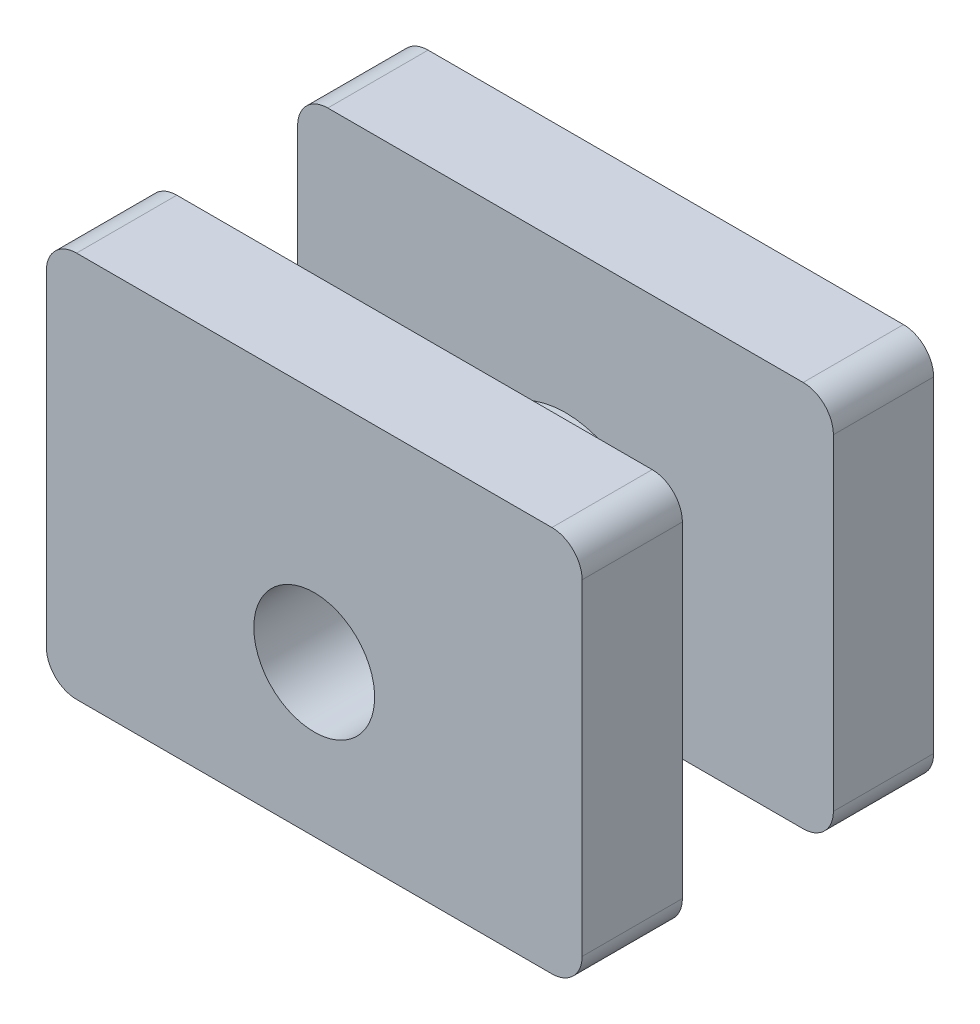
ISO-10303-21;
HEADER;
FILE_DESCRIPTION(('STEP AP214'),'2;1');
FILE_NAME('part.step','',(''),(''),'','','');
FILE_SCHEMA(('AUTOMOTIVE_DESIGN { 1 0 10303 214 1 1 1 1 }'));
ENDSEC;
DATA;
#1=APPLICATION_CONTEXT('core data for automotive mechanical design processes');
#2=APPLICATION_PROTOCOL_DEFINITION('international standard','automotive_design',2000,#1);
#3=PRODUCT_CONTEXT('',#1,'mechanical');
#4=PRODUCT('Part','Part','',(#3));
#5=PRODUCT_RELATED_PRODUCT_CATEGORY('part','',(#4));
#6=PRODUCT_DEFINITION_FORMATION('','',#4);
#7=PRODUCT_DEFINITION_CONTEXT('part definition',#1,'design');
#8=PRODUCT_DEFINITION('design','',#6,#7);
#9=PRODUCT_DEFINITION_SHAPE('','',#8);
#10=(LENGTH_UNIT() NAMED_UNIT(*) SI_UNIT(.MILLI.,.METRE.));
#11=(NAMED_UNIT(*) PLANE_ANGLE_UNIT() SI_UNIT($,.RADIAN.));
#12=(NAMED_UNIT(*) SI_UNIT($,.STERADIAN.) SOLID_ANGLE_UNIT());
#13=UNCERTAINTY_MEASURE_WITH_UNIT(LENGTH_MEASURE(1.E-05),#10,'distance_accuracy_value','');
#14=(GEOMETRIC_REPRESENTATION_CONTEXT(3) GLOBAL_UNCERTAINTY_ASSIGNED_CONTEXT((#13)) GLOBAL_UNIT_ASSIGNED_CONTEXT((#10,
#11,#12)) REPRESENTATION_CONTEXT('',''));
#15=CARTESIAN_POINT('',(0.,0.,0.));
#16=DIRECTION('',(0.,0.,1.));
#17=DIRECTION('',(1.,0.,0.));
#18=AXIS2_PLACEMENT_3D('',#15,#16,#17);
#19=CARTESIAN_POINT('',(3.935,2.7,-2.91));
#20=DIRECTION('',(0.,0.,-1.));
#21=DIRECTION('',(-1.,0.,0.));
#22=AXIS2_PLACEMENT_3D('',#19,#20,#21);
#23=CYLINDRICAL_SURFACE('',#22,0.500000000000003);
#24=CARTESIAN_POINT('',(3.935,2.7,-2.91));
#25=DIRECTION('',(0.,0.,-1.));
#26=DIRECTION('',(-1.,0.,0.));
#27=AXIS2_PLACEMENT_3D('',#24,#25,#26);
#28=CIRCLE('',#27,0.500000000000003);
#29=CARTESIAN_POINT('',(4.435,2.7,-2.91));
#30=VERTEX_POINT('',#29);
#31=CARTESIAN_POINT('',(3.935,3.2,-2.91));
#32=VERTEX_POINT('',#31);
#33=EDGE_CURVE('E156',#30,#32,#28,.F.);
#34=ORIENTED_EDGE('',*,*,#33,.T.);
#35=DIRECTION('',(0.,0.,1.));
#36=VECTOR('',#35,1.);
#37=CARTESIAN_POINT('',(3.935,3.2,-2.993));
#38=LINE('',#37,#36);
#39=CARTESIAN_POINT('',(3.935,3.2,-1.25));
#40=VERTEX_POINT('',#39);
#41=EDGE_CURVE('E154',#40,#32,#38,.F.);
#42=ORIENTED_EDGE('',*,*,#41,.F.);
#43=CARTESIAN_POINT('',(3.935,2.7,-1.25));
#44=DIRECTION('',(0.,0.,-1.));
#45=DIRECTION('',(-1.,0.,0.));
#46=AXIS2_PLACEMENT_3D('',#43,#44,#45);
#47=CIRCLE('',#46,0.500000000000003);
#48=CARTESIAN_POINT('',(4.435,2.7,-1.25));
#49=VERTEX_POINT('',#48);
#50=EDGE_CURVE('E20',#40,#49,#47,.T.);
#51=ORIENTED_EDGE('',*,*,#50,.T.);
#52=DIRECTION('',(0.,0.,-1.));
#53=VECTOR('',#52,1.);
#54=CARTESIAN_POINT('',(4.435,2.7,-1.167));
#55=LINE('',#54,#53);
#56=EDGE_CURVE('E151',#30,#49,#55,.F.);
#57=ORIENTED_EDGE('',*,*,#56,.F.);
#58=EDGE_LOOP('',(#34,#42,#51,#57));
#59=FACE_BOUND('',#58,.T.);
#60=ADVANCED_FACE('F17',(#59),#23,.T.);
#61=CARTESIAN_POINT('',(-3.935,2.7,-1.25));
#62=DIRECTION('',(0.,0.,1.));
#63=DIRECTION('',(1.,0.,0.));
#64=AXIS2_PLACEMENT_3D('',#61,#62,#63);
#65=CYLINDRICAL_SURFACE('',#64,0.500000000000003);
#66=CARTESIAN_POINT('',(-3.935,2.7,-2.91));
#67=DIRECTION('',(0.,0.,1.));
#68=DIRECTION('',(1.,0.,0.));
#69=AXIS2_PLACEMENT_3D('',#66,#67,#68);
#70=CIRCLE('',#69,0.500000000000003);
#71=CARTESIAN_POINT('',(-3.935,3.2,-2.91));
#72=VERTEX_POINT('',#71);
#73=CARTESIAN_POINT('',(-4.435,2.7,-2.91));
#74=VERTEX_POINT('',#73);
#75=EDGE_CURVE('E278',#72,#74,#70,.T.);
#76=ORIENTED_EDGE('',*,*,#75,.T.);
#77=DIRECTION('',(0.,0.,1.));
#78=VECTOR('',#77,1.);
#79=CARTESIAN_POINT('',(-4.435,2.7,-2.993));
#80=LINE('',#79,#78);
#81=CARTESIAN_POINT('',(-4.435,2.7,-1.25));
#82=VERTEX_POINT('',#81);
#83=EDGE_CURVE('E228',#82,#74,#80,.F.);
#84=ORIENTED_EDGE('',*,*,#83,.F.);
#85=CARTESIAN_POINT('',(-3.935,2.7,-1.25));
#86=DIRECTION('',(0.,0.,1.));
#87=DIRECTION('',(1.,0.,0.));
#88=AXIS2_PLACEMENT_3D('',#85,#86,#87);
#89=CIRCLE('',#88,0.500000000000003);
#90=CARTESIAN_POINT('',(-3.935,3.2,-1.25));
#91=VERTEX_POINT('',#90);
#92=EDGE_CURVE('E280',#82,#91,#89,.F.);
#93=ORIENTED_EDGE('',*,*,#92,.T.);
#94=DIRECTION('',(0.,0.,1.));
#95=VECTOR('',#94,1.);
#96=CARTESIAN_POINT('',(-3.935,3.2,-2.993));
#97=LINE('',#96,#95);
#98=EDGE_CURVE('E236',#72,#91,#97,.T.);
#99=ORIENTED_EDGE('',*,*,#98,.F.);
#100=EDGE_LOOP('',(#76,#84,#93,#99));
#101=FACE_BOUND('',#100,.T.);
#102=ADVANCED_FACE('F290',(#101),#65,.T.);
#103=CARTESIAN_POINT('',(-3.935,2.7,2.91));
#104=DIRECTION('',(0.,0.,1.));
#105=DIRECTION('',(1.,0.,0.));
#106=AXIS2_PLACEMENT_3D('',#103,#104,#105);
#107=CYLINDRICAL_SURFACE('',#106,0.500000000000003);
#108=CARTESIAN_POINT('',(-3.935,2.7,2.91));
#109=DIRECTION('',(0.,0.,1.));
#110=DIRECTION('',(1.,0.,0.));
#111=AXIS2_PLACEMENT_3D('',#108,#109,#110);
#112=CIRCLE('',#111,0.500000000000003);
#113=CARTESIAN_POINT('',(-4.435,2.7,2.91));
#114=VERTEX_POINT('',#113);
#115=CARTESIAN_POINT('',(-3.935,3.2,2.91));
#116=VERTEX_POINT('',#115);
#117=EDGE_CURVE('E274',#114,#116,#112,.F.);
#118=ORIENTED_EDGE('',*,*,#117,.T.);
#119=DIRECTION('',(0.,0.,1.));
#120=VECTOR('',#119,1.);
#121=CARTESIAN_POINT('',(-3.935,3.2,0.));
#122=LINE('',#121,#120);
#123=CARTESIAN_POINT('',(-3.935,3.2,1.25));
#124=VERTEX_POINT('',#123);
#125=EDGE_CURVE('E220',#124,#116,#122,.T.);
#126=ORIENTED_EDGE('',*,*,#125,.F.);
#127=CARTESIAN_POINT('',(-3.935,2.7,1.25));
#128=DIRECTION('',(0.,0.,1.));
#129=DIRECTION('',(1.,0.,0.));
#130=AXIS2_PLACEMENT_3D('',#127,#128,#129);
#131=CIRCLE('',#130,0.500000000000003);
#132=CARTESIAN_POINT('',(-4.435,2.7,1.25));
#133=VERTEX_POINT('',#132);
#134=EDGE_CURVE('E276',#124,#133,#131,.T.);
#135=ORIENTED_EDGE('',*,*,#134,.T.);
#136=DIRECTION('',(0.,0.,1.));
#137=VECTOR('',#136,1.);
#138=CARTESIAN_POINT('',(-4.435,2.7,0.));
#139=LINE('',#138,#137);
#140=EDGE_CURVE('E223',#114,#133,#139,.F.);
#141=ORIENTED_EDGE('',*,*,#140,.F.);
#142=EDGE_LOOP('',(#118,#126,#135,#141));
#143=FACE_BOUND('',#142,.T.);
#144=ADVANCED_FACE('F379',(#143),#107,.T.);
#145=CARTESIAN_POINT('',(3.935,2.7,1.25));
#146=DIRECTION('',(0.,0.,-1.));
#147=DIRECTION('',(-1.,0.,0.));
#148=AXIS2_PLACEMENT_3D('',#145,#146,#147);
#149=CYLINDRICAL_SURFACE('',#148,0.500000000000003);
#150=CARTESIAN_POINT('',(3.935,2.7,2.91));
#151=DIRECTION('',(0.,0.,-1.));
#152=DIRECTION('',(-1.,0.,0.));
#153=AXIS2_PLACEMENT_3D('',#150,#151,#152);
#154=CIRCLE('',#153,0.500000000000003);
#155=CARTESIAN_POINT('',(3.935,3.2,2.91));
#156=VERTEX_POINT('',#155);
#157=CARTESIAN_POINT('',(4.435,2.7,2.91));
#158=VERTEX_POINT('',#157);
#159=EDGE_CURVE('E164',#156,#158,#154,.T.);
#160=ORIENTED_EDGE('',*,*,#159,.T.);
#161=DIRECTION('',(0.,0.,-1.));
#162=VECTOR('',#161,1.);
#163=CARTESIAN_POINT('',(4.435,2.7,2.993));
#164=LINE('',#163,#162);
#165=CARTESIAN_POINT('',(4.435,2.7,1.25));
#166=VERTEX_POINT('',#165);
#167=EDGE_CURVE('E215',#166,#158,#164,.F.);
#168=ORIENTED_EDGE('',*,*,#167,.F.);
#169=CARTESIAN_POINT('',(3.935,2.7,1.25));
#170=DIRECTION('',(0.,0.,-1.));
#171=DIRECTION('',(-1.,0.,0.));
#172=AXIS2_PLACEMENT_3D('',#169,#170,#171);
#173=CIRCLE('',#172,0.500000000000003);
#174=CARTESIAN_POINT('',(3.935,3.2,1.25));
#175=VERTEX_POINT('',#174);
#176=EDGE_CURVE('E272',#166,#175,#173,.F.);
#177=ORIENTED_EDGE('',*,*,#176,.T.);
#178=DIRECTION('',(0.,0.,1.));
#179=VECTOR('',#178,1.);
#180=CARTESIAN_POINT('',(3.935,3.2,0.));
#181=LINE('',#180,#179);
#182=EDGE_CURVE('E219',#156,#175,#181,.F.);
#183=ORIENTED_EDGE('',*,*,#182,.F.);
#184=EDGE_LOOP('',(#160,#168,#177,#183));
#185=FACE_BOUND('',#184,.T.);
#186=ADVANCED_FACE('F388',(#185),#149,.T.);
#187=CARTESIAN_POINT('',(4.435,-2.97,-1.167));
#188=DIRECTION('',(1.,0.,0.));
#189=DIRECTION('',(0.,0.,-1.));
#190=AXIS2_PLACEMENT_3D('',#187,#188,#189);
#191=PLANE('',#190);
#192=DIRECTION('',(0.,1.,0.));
#193=VECTOR('',#192,1.);
#194=CARTESIAN_POINT('',(4.435,-3.52,-2.91));
#195=LINE('',#194,#193);
#196=CARTESIAN_POINT('',(4.435,-2.7,-2.91));
#197=VERTEX_POINT('',#196);
#198=EDGE_CURVE('E163',#30,#197,#195,.F.);
#199=ORIENTED_EDGE('',*,*,#198,.F.);
#200=ORIENTED_EDGE('',*,*,#56,.T.);
#201=DIRECTION('',(0.,1.,0.));
#202=VECTOR('',#201,1.);
#203=CARTESIAN_POINT('',(4.435,-3.52,-1.25));
#204=LINE('',#203,#202);
#205=CARTESIAN_POINT('',(4.435,-2.7,-1.25));
#206=VERTEX_POINT('',#205);
#207=EDGE_CURVE('E161',#206,#49,#204,.T.);
#208=ORIENTED_EDGE('',*,*,#207,.F.);
#209=DIRECTION('',(0.,0.,1.));
#210=VECTOR('',#209,1.);
#211=CARTESIAN_POINT('',(4.43499999999999,-2.7,-1.4965));
#212=LINE('',#211,#210);
#213=EDGE_CURVE('E177',#197,#206,#212,.T.);
#214=ORIENTED_EDGE('',*,*,#213,.F.);
#215=EDGE_LOOP('',(#199,#200,#208,#214));
#216=FACE_BOUND('',#215,.T.);
#217=ADVANCED_FACE('F159',(#216),#191,.T.);
#218=CARTESIAN_POINT('',(-4.3285,3.2,-2.993));
#219=DIRECTION('',(0.,1.,0.));
#220=DIRECTION('',(0.,0.,1.));
#221=AXIS2_PLACEMENT_3D('',#218,#219,#220);
#222=PLANE('',#221);
#223=DIRECTION('',(-1.,0.,0.));
#224=VECTOR('',#223,1.);
#225=CARTESIAN_POINT('',(4.8785,3.2,-2.91));
#226=LINE('',#225,#224);
#227=EDGE_CURVE('E190',#72,#32,#226,.F.);
#228=ORIENTED_EDGE('',*,*,#227,.F.);
#229=ORIENTED_EDGE('',*,*,#98,.T.);
#230=DIRECTION('',(1.,0.,0.));
#231=VECTOR('',#230,1.);
#232=CARTESIAN_POINT('',(-4.8785,3.2,-1.25));
#233=LINE('',#232,#231);
#234=EDGE_CURVE('E169',#40,#91,#233,.F.);
#235=ORIENTED_EDGE('',*,*,#234,.F.);
#236=ORIENTED_EDGE('',*,*,#41,.T.);
#237=EDGE_LOOP('',(#228,#229,#235,#236));
#238=FACE_BOUND('',#237,.T.);
#239=ADVANCED_FACE('F284',(#238),#222,.T.);
#240=CARTESIAN_POINT('',(-4.435,-2.97,-2.993));
#241=DIRECTION('',(-1.,0.,0.));
#242=DIRECTION('',(0.,0.,1.));
#243=AXIS2_PLACEMENT_3D('',#240,#241,#242);
#244=PLANE('',#243);
#245=DIRECTION('',(0.,1.,0.));
#246=VECTOR('',#245,1.);
#247=CARTESIAN_POINT('',(-4.435,-3.52,-2.91));
#248=LINE('',#247,#246);
#249=CARTESIAN_POINT('',(-4.435,-2.7,-2.91));
#250=VERTEX_POINT('',#249);
#251=EDGE_CURVE('E193',#250,#74,#248,.T.);
#252=ORIENTED_EDGE('',*,*,#251,.F.);
#253=DIRECTION('',(0.,0.,-1.));
#254=VECTOR('',#253,1.);
#255=CARTESIAN_POINT('',(-4.435,-2.7,-1.4965));
#256=LINE('',#255,#254);
#257=CARTESIAN_POINT('',(-4.435,-2.7,-1.25));
#258=VERTEX_POINT('',#257);
#259=EDGE_CURVE('E218',#258,#250,#256,.T.);
#260=ORIENTED_EDGE('',*,*,#259,.F.);
#261=DIRECTION('',(0.,1.,0.));
#262=VECTOR('',#261,1.);
#263=CARTESIAN_POINT('',(-4.435,-3.52,-1.25));
#264=LINE('',#263,#262);
#265=EDGE_CURVE('E171',#82,#258,#264,.F.);
#266=ORIENTED_EDGE('',*,*,#265,.F.);
#267=ORIENTED_EDGE('',*,*,#83,.T.);
#268=EDGE_LOOP('',(#252,#260,#266,#267));
#269=FACE_BOUND('',#268,.T.);
#270=ADVANCED_FACE('F294',(#269),#244,.T.);
#271=CARTESIAN_POINT('',(0.,-0.699999999999998,2.91));
#272=DIRECTION('',(0.,0.,-1.));
#273=DIRECTION('',(-1.,0.,0.));
#274=AXIS2_PLACEMENT_3D('',#271,#272,#273);
#275=CYLINDRICAL_SURFACE('',#274,1.);
#276=CARTESIAN_POINT('',(0.,-0.699999999999998,-2.91));
#277=DIRECTION('',(0.,0.,-1.));
#278=DIRECTION('',(-1.,0.,0.));
#279=AXIS2_PLACEMENT_3D('',#276,#277,#278);
#280=CIRCLE('',#279,1.);
#281=CARTESIAN_POINT('',(-1.,-0.699999999999998,-2.91));
#282=VERTEX_POINT('',#281);
#283=EDGE_CURVE('E189',#282,#282,#280,.F.);
#284=ORIENTED_EDGE('',*,*,#283,.F.);
#285=EDGE_LOOP('',(#284));
#286=FACE_BOUND('',#285,.T.);
#287=CARTESIAN_POINT('',(0.,-0.699999999999998,2.91));
#288=DIRECTION('',(0.,0.,-1.));
#289=DIRECTION('',(-1.,0.,0.));
#290=AXIS2_PLACEMENT_3D('',#287,#288,#289);
#291=CIRCLE('',#290,1.);
#292=CARTESIAN_POINT('',(-1.,-0.699999999999998,2.91));
#293=VERTEX_POINT('',#292);
#294=EDGE_CURVE('E256',#293,#293,#291,.T.);
#295=ORIENTED_EDGE('',*,*,#294,.F.);
#296=EDGE_LOOP('',(#295));
#297=FACE_BOUND('',#296,.T.);
#298=ADVANCED_FACE('F502',(#286,#297),#275,.F.);
#299=CARTESIAN_POINT('',(-4.435,-3.2,0.));
#300=DIRECTION('',(-1.,0.,0.));
#301=DIRECTION('',(0.,0.,1.));
#302=AXIS2_PLACEMENT_3D('',#299,#300,#301);
#303=PLANE('',#302);
#304=DIRECTION('',(0.,1.,0.));
#305=VECTOR('',#304,1.);
#306=CARTESIAN_POINT('',(-4.435,-3.52,2.91));
#307=LINE('',#306,#305);
#308=CARTESIAN_POINT('',(-4.435,-2.7,2.91));
#309=VERTEX_POINT('',#308);
#310=EDGE_CURVE('E259',#114,#309,#307,.F.);
#311=ORIENTED_EDGE('',*,*,#310,.F.);
#312=ORIENTED_EDGE('',*,*,#140,.T.);
#313=DIRECTION('',(0.,1.,0.));
#314=VECTOR('',#313,1.);
#315=CARTESIAN_POINT('',(-4.435,-3.52,1.25));
#316=LINE('',#315,#314);
#317=CARTESIAN_POINT('',(-4.435,-2.7,1.25));
#318=VERTEX_POINT('',#317);
#319=EDGE_CURVE('E253',#318,#133,#316,.T.);
#320=ORIENTED_EDGE('',*,*,#319,.F.);
#321=DIRECTION('',(0.,0.,-1.));
#322=VECTOR('',#321,1.);
#323=CARTESIAN_POINT('',(-4.435,-2.7,2.08));
#324=LINE('',#323,#322);
#325=EDGE_CURVE('E229',#309,#318,#324,.T.);
#326=ORIENTED_EDGE('',*,*,#325,.F.);
#327=EDGE_LOOP('',(#311,#312,#320,#326));
#328=FACE_BOUND('',#327,.T.);
#329=ADVANCED_FACE('F376',(#328),#303,.T.);
#330=CARTESIAN_POINT('',(-4.435,3.2,0.));
#331=DIRECTION('',(0.,1.,0.));
#332=DIRECTION('',(0.,0.,1.));
#333=AXIS2_PLACEMENT_3D('',#330,#331,#332);
#334=PLANE('',#333);
#335=DIRECTION('',(1.,0.,0.));
#336=VECTOR('',#335,1.);
#337=CARTESIAN_POINT('',(-4.8785,3.2,2.91));
#338=LINE('',#337,#336);
#339=EDGE_CURVE('E320',#156,#116,#338,.F.);
#340=ORIENTED_EDGE('',*,*,#339,.F.);
#341=ORIENTED_EDGE('',*,*,#182,.T.);
#342=DIRECTION('',(-1.,0.,0.));
#343=VECTOR('',#342,1.);
#344=CARTESIAN_POINT('',(4.8785,3.2,1.25));
#345=LINE('',#344,#343);
#346=EDGE_CURVE('E341',#124,#175,#345,.F.);
#347=ORIENTED_EDGE('',*,*,#346,.F.);
#348=ORIENTED_EDGE('',*,*,#125,.T.);
#349=EDGE_LOOP('',(#340,#341,#347,#348));
#350=FACE_BOUND('',#349,.T.);
#351=ADVANCED_FACE('F383',(#350),#334,.T.);
#352=CARTESIAN_POINT('',(4.435,-2.97,2.993));
#353=DIRECTION('',(1.,0.,0.));
#354=DIRECTION('',(0.,0.,-1.));
#355=AXIS2_PLACEMENT_3D('',#352,#353,#354);
#356=PLANE('',#355);
#357=DIRECTION('',(0.,1.,0.));
#358=VECTOR('',#357,1.);
#359=CARTESIAN_POINT('',(4.435,-3.52,2.91));
#360=LINE('',#359,#358);
#361=CARTESIAN_POINT('',(4.435,-2.7,2.91));
#362=VERTEX_POINT('',#361);
#363=EDGE_CURVE('E262',#362,#158,#360,.T.);
#364=ORIENTED_EDGE('',*,*,#363,.F.);
#365=DIRECTION('',(0.,0.,1.));
#366=VECTOR('',#365,1.);
#367=CARTESIAN_POINT('',(4.43499999999999,-2.7,2.08));
#368=LINE('',#367,#366);
#369=CARTESIAN_POINT('',(4.435,-2.7,1.25));
#370=VERTEX_POINT('',#369);
#371=EDGE_CURVE('E211',#370,#362,#368,.T.);
#372=ORIENTED_EDGE('',*,*,#371,.F.);
#373=DIRECTION('',(0.,1.,0.));
#374=VECTOR('',#373,1.);
#375=CARTESIAN_POINT('',(4.435,-3.52,1.25));
#376=LINE('',#375,#374);
#377=EDGE_CURVE('E249',#166,#370,#376,.F.);
#378=ORIENTED_EDGE('',*,*,#377,.F.);
#379=ORIENTED_EDGE('',*,*,#167,.T.);
#380=EDGE_LOOP('',(#364,#372,#378,#379));
#381=FACE_BOUND('',#380,.T.);
#382=ADVANCED_FACE('F391',(#381),#356,.T.);
#383=CARTESIAN_POINT('',(-3.935,-2.7,-2.91));
#384=DIRECTION('',(0.,0.,-1.));
#385=DIRECTION('',(-1.,0.,0.));
#386=AXIS2_PLACEMENT_3D('',#383,#384,#385);
#387=CYLINDRICAL_SURFACE('',#386,0.500000000000003);
#388=CARTESIAN_POINT('',(-3.935,-2.7,-2.91));
#389=DIRECTION('',(0.,0.,-1.));
#390=DIRECTION('',(-1.,0.,0.));
#391=AXIS2_PLACEMENT_3D('',#388,#389,#390);
#392=CIRCLE('',#391,0.500000000000003);
#393=CARTESIAN_POINT('',(-3.935,-3.2,-2.91));
#394=VERTEX_POINT('',#393);
#395=EDGE_CURVE('E196',#394,#250,#392,.T.);
#396=ORIENTED_EDGE('',*,*,#395,.F.);
#397=DIRECTION('',(0.,0.,-1.));
#398=VECTOR('',#397,1.);
#399=CARTESIAN_POINT('',(-3.935,-3.2,3.201));
#400=LINE('',#399,#398);
#401=CARTESIAN_POINT('',(-3.935,-3.2,-1.25));
#402=VERTEX_POINT('',#401);
#403=EDGE_CURVE('E187',#402,#394,#400,.T.);
#404=ORIENTED_EDGE('',*,*,#403,.F.);
#405=CARTESIAN_POINT('',(-3.935,-2.7,-1.25));
#406=DIRECTION('',(0.,0.,-1.));
#407=DIRECTION('',(-1.,0.,0.));
#408=AXIS2_PLACEMENT_3D('',#405,#406,#407);
#409=CIRCLE('',#408,0.500000000000003);
#410=EDGE_CURVE('E263',#258,#402,#409,.F.);
#411=ORIENTED_EDGE('',*,*,#410,.F.);
#412=ORIENTED_EDGE('',*,*,#259,.T.);
#413=EDGE_LOOP('',(#396,#404,#411,#412));
#414=FACE_BOUND('',#413,.T.);
#415=ADVANCED_FACE('F400',(#414),#387,.T.);
#416=CARTESIAN_POINT('',(4.8785,-3.52,-2.91));
#417=DIRECTION('',(0.,0.,-1.));
#418=DIRECTION('',(-1.,0.,0.));
#419=AXIS2_PLACEMENT_3D('',#416,#417,#418);
#420=PLANE('',#419);
#421=ORIENTED_EDGE('',*,*,#283,.T.);
#422=EDGE_LOOP('',(#421));
#423=FACE_BOUND('',#422,.T.);
#424=ORIENTED_EDGE('',*,*,#198,.T.);
#425=CARTESIAN_POINT('',(3.935,-2.7,-2.91));
#426=DIRECTION('',(0.,0.,-1.));
#427=DIRECTION('',(-1.,0.,0.));
#428=AXIS2_PLACEMENT_3D('',#425,#426,#427);
#429=CIRCLE('',#428,0.499999999999995);
#430=CARTESIAN_POINT('',(3.935,-3.2,-2.91));
#431=VERTEX_POINT('',#430);
#432=EDGE_CURVE('E241',#431,#197,#429,.F.);
#433=ORIENTED_EDGE('',*,*,#432,.F.);
#434=DIRECTION('',(1.,0.,0.));
#435=VECTOR('',#434,1.);
#436=CARTESIAN_POINT('',(-4.3285,-3.2,-2.91));
#437=LINE('',#436,#435);
#438=EDGE_CURVE('E184',#394,#431,#437,.T.);
#439=ORIENTED_EDGE('',*,*,#438,.F.);
#440=ORIENTED_EDGE('',*,*,#395,.T.);
#441=ORIENTED_EDGE('',*,*,#251,.T.);
#442=ORIENTED_EDGE('',*,*,#75,.F.);
#443=ORIENTED_EDGE('',*,*,#227,.T.);
#444=ORIENTED_EDGE('',*,*,#33,.F.);
#445=EDGE_LOOP('',(#424,#433,#439,#440,#441,#442,#443,#444));
#446=FACE_BOUND('',#445,.T.);
#447=ADVANCED_FACE('F285',(#423,#446),#420,.T.);
#448=CARTESIAN_POINT('',(3.935,-2.7,-2.91));
#449=DIRECTION('',(0.,0.,-1.));
#450=DIRECTION('',(-1.,0.,0.));
#451=AXIS2_PLACEMENT_3D('',#448,#449,#450);
#452=CYLINDRICAL_SURFACE('',#451,0.499999999999995);
#453=ORIENTED_EDGE('',*,*,#432,.T.);
#454=ORIENTED_EDGE('',*,*,#213,.T.);
#455=CARTESIAN_POINT('',(3.935,-2.7,-1.25));
#456=DIRECTION('',(0.,0.,-1.));
#457=DIRECTION('',(-1.,0.,0.));
#458=AXIS2_PLACEMENT_3D('',#455,#456,#457);
#459=CIRCLE('',#458,0.499999999999995);
#460=CARTESIAN_POINT('',(3.935,-3.2,-1.25));
#461=VERTEX_POINT('',#460);
#462=EDGE_CURVE('E168',#461,#206,#459,.F.);
#463=ORIENTED_EDGE('',*,*,#462,.F.);
#464=DIRECTION('',(0.,0.,-1.));
#465=VECTOR('',#464,1.);
#466=CARTESIAN_POINT('',(3.935,-3.2,3.201));
#467=LINE('',#466,#465);
#468=EDGE_CURVE('E180',#431,#461,#467,.F.);
#469=ORIENTED_EDGE('',*,*,#468,.F.);
#470=EDGE_LOOP('',(#453,#454,#463,#469));
#471=FACE_BOUND('',#470,.T.);
#472=ADVANCED_FACE('F403',(#471),#452,.T.);
#473=CARTESIAN_POINT('',(-4.8785,-3.52,-1.25));
#474=DIRECTION('',(0.,0.,1.));
#475=DIRECTION('',(1.,0.,0.));
#476=AXIS2_PLACEMENT_3D('',#473,#474,#475);
#477=PLANE('',#476);
#478=ORIENTED_EDGE('',*,*,#410,.T.);
#479=DIRECTION('',(1.,0.,0.));
#480=VECTOR('',#479,1.);
#481=CARTESIAN_POINT('',(-4.3285,-3.2,-1.25));
#482=LINE('',#481,#480);
#483=CARTESIAN_POINT('',(-1.,-3.2,-1.25));
#484=VERTEX_POINT('',#483);
#485=EDGE_CURVE('E199',#484,#402,#482,.F.);
#486=ORIENTED_EDGE('',*,*,#485,.F.);
#487=DIRECTION('',(0.,1.,0.));
#488=VECTOR('',#487,1.);
#489=CARTESIAN_POINT('',(-0.999999999999999,-3.52,-1.25));
#490=LINE('',#489,#488);
#491=CARTESIAN_POINT('',(-1.,-1.8180339887499,-1.25));
#492=VERTEX_POINT('',#491);
#493=EDGE_CURVE('E34',#484,#492,#490,.T.);
#494=ORIENTED_EDGE('',*,*,#493,.T.);
#495=CARTESIAN_POINT('',(0.,-0.699999999999998,-1.25));
#496=DIRECTION('',(0.,0.,-1.));
#497=DIRECTION('',(-1.,0.,0.));
#498=AXIS2_PLACEMENT_3D('',#495,#496,#497);
#499=CIRCLE('',#498,1.5);
#500=CARTESIAN_POINT('',(0.999999999999998,-1.81803398874989,-1.25));
#501=VERTEX_POINT('',#500);
#502=EDGE_CURVE('E202',#501,#492,#499,.F.);
#503=ORIENTED_EDGE('',*,*,#502,.F.);
#504=DIRECTION('',(0.,1.,0.));
#505=VECTOR('',#504,1.);
#506=CARTESIAN_POINT('',(1.,-3.26909830056251,-1.25));
#507=LINE('',#506,#505);
#508=CARTESIAN_POINT('',(1.,-3.2,-1.25));
#509=VERTEX_POINT('',#508);
#510=EDGE_CURVE('E214',#509,#501,#507,.T.);
#511=ORIENTED_EDGE('',*,*,#510,.F.);
#512=DIRECTION('',(1.,0.,0.));
#513=VECTOR('',#512,1.);
#514=CARTESIAN_POINT('',(-4.3285,-3.2,-1.25));
#515=LINE('',#514,#513);
#516=EDGE_CURVE('E183',#461,#509,#515,.F.);
#517=ORIENTED_EDGE('',*,*,#516,.F.);
#518=ORIENTED_EDGE('',*,*,#462,.T.);
#519=ORIENTED_EDGE('',*,*,#207,.T.);
#520=ORIENTED_EDGE('',*,*,#50,.F.);
#521=ORIENTED_EDGE('',*,*,#234,.T.);
#522=ORIENTED_EDGE('',*,*,#92,.F.);
#523=ORIENTED_EDGE('',*,*,#265,.T.);
#524=EDGE_LOOP('',(#478,#486,#494,#503,#511,#517,#518,#519,#520,#521,#522,#523));
#525=FACE_BOUND('',#524,.T.);
#526=ADVANCED_FACE('F166',(#525),#477,.T.);
#527=CARTESIAN_POINT('',(1.,-3.26909830056251,1.375));
#528=DIRECTION('',(1.,0.,0.));
#529=DIRECTION('',(0.,0.,-1.));
#530=AXIS2_PLACEMENT_3D('',#527,#528,#529);
#531=PLANE('',#530);
#532=ORIENTED_EDGE('',*,*,#510,.T.);
#533=DIRECTION('',(0.,0.,-1.));
#534=VECTOR('',#533,1.);
#535=CARTESIAN_POINT('',(0.999999999999997,-1.8180339887499,0.));
#536=LINE('',#535,#534);
#537=CARTESIAN_POINT('',(0.999999999999998,-1.81803398874989,1.25));
#538=VERTEX_POINT('',#537);
#539=EDGE_CURVE('E205',#538,#501,#536,.T.);
#540=ORIENTED_EDGE('',*,*,#539,.F.);
#541=DIRECTION('',(0.,1.,0.));
#542=VECTOR('',#541,1.);
#543=CARTESIAN_POINT('',(1.,-3.52,1.25));
#544=LINE('',#543,#542);
#545=CARTESIAN_POINT('',(1.,-3.2,1.25));
#546=VERTEX_POINT('',#545);
#547=EDGE_CURVE('E246',#546,#538,#544,.T.);
#548=ORIENTED_EDGE('',*,*,#547,.F.);
#549=DIRECTION('',(0.,0.,-1.));
#550=VECTOR('',#549,1.);
#551=CARTESIAN_POINT('',(1.,-3.2,3.201));
#552=LINE('',#551,#550);
#553=EDGE_CURVE('E301',#509,#546,#552,.F.);
#554=ORIENTED_EDGE('',*,*,#553,.F.);
#555=EDGE_LOOP('',(#532,#540,#548,#554));
#556=FACE_BOUND('',#555,.T.);
#557=ADVANCED_FACE('F357',(#556),#531,.T.);
#558=CARTESIAN_POINT('',(3.935,-2.7,1.25));
#559=DIRECTION('',(0.,0.,-1.));
#560=DIRECTION('',(0.,1.,0.));
#561=AXIS2_PLACEMENT_3D('',#558,#559,#560);
#562=CYLINDRICAL_SURFACE('',#561,0.499999999999995);
#563=CARTESIAN_POINT('',(3.935,-2.7,2.91));
#564=DIRECTION('',(0.,0.,-1.));
#565=DIRECTION('',(0.,1.,0.));
#566=AXIS2_PLACEMENT_3D('',#563,#564,#565);
#567=CIRCLE('',#566,0.499999999999995);
#568=CARTESIAN_POINT('',(3.935,-3.2,2.91));
#569=VERTEX_POINT('',#568);
#570=EDGE_CURVE('E213',#569,#362,#567,.F.);
#571=ORIENTED_EDGE('',*,*,#570,.F.);
#572=DIRECTION('',(0.,0.,-1.));
#573=VECTOR('',#572,1.);
#574=CARTESIAN_POINT('',(3.935,-3.2,3.201));
#575=LINE('',#574,#573);
#576=CARTESIAN_POINT('',(3.935,-3.2,1.25));
#577=VERTEX_POINT('',#576);
#578=EDGE_CURVE('E314',#577,#569,#575,.F.);
#579=ORIENTED_EDGE('',*,*,#578,.F.);
#580=CARTESIAN_POINT('',(3.935,-2.7,1.25));
#581=DIRECTION('',(0.,0.,-1.));
#582=DIRECTION('',(0.,1.,0.));
#583=AXIS2_PLACEMENT_3D('',#580,#581,#582);
#584=CIRCLE('',#583,0.499999999999995);
#585=EDGE_CURVE('E247',#370,#577,#584,.T.);
#586=ORIENTED_EDGE('',*,*,#585,.F.);
#587=ORIENTED_EDGE('',*,*,#371,.T.);
#588=EDGE_LOOP('',(#571,#579,#586,#587));
#589=FACE_BOUND('',#588,.T.);
#590=ADVANCED_FACE('F395',(#589),#562,.T.);
#591=CARTESIAN_POINT('',(-4.8785,-3.52,2.91));
#592=DIRECTION('',(0.,0.,1.));
#593=DIRECTION('',(1.,0.,0.));
#594=AXIS2_PLACEMENT_3D('',#591,#592,#593);
#595=PLANE('',#594);
#596=ORIENTED_EDGE('',*,*,#294,.T.);
#597=EDGE_LOOP('',(#596));
#598=FACE_BOUND('',#597,.T.);
#599=ORIENTED_EDGE('',*,*,#310,.T.);
#600=CARTESIAN_POINT('',(-3.935,-2.7,2.91));
#601=DIRECTION('',(0.,0.,-1.));
#602=DIRECTION('',(-1.,0.,0.));
#603=AXIS2_PLACEMENT_3D('',#600,#601,#602);
#604=CIRCLE('',#603,0.500000000000003);
#605=CARTESIAN_POINT('',(-3.935,-3.2,2.91));
#606=VERTEX_POINT('',#605);
#607=EDGE_CURVE('E232',#606,#309,#604,.T.);
#608=ORIENTED_EDGE('',*,*,#607,.F.);
#609=DIRECTION('',(1.,0.,0.));
#610=VECTOR('',#609,1.);
#611=CARTESIAN_POINT('',(-4.3285,-3.2,2.91));
#612=LINE('',#611,#610);
#613=EDGE_CURVE('E317',#569,#606,#612,.F.);
#614=ORIENTED_EDGE('',*,*,#613,.F.);
#615=ORIENTED_EDGE('',*,*,#570,.T.);
#616=ORIENTED_EDGE('',*,*,#363,.T.);
#617=ORIENTED_EDGE('',*,*,#159,.F.);
#618=ORIENTED_EDGE('',*,*,#339,.T.);
#619=ORIENTED_EDGE('',*,*,#117,.F.);
#620=EDGE_LOOP('',(#599,#608,#614,#615,#616,#617,#618,#619));
#621=FACE_BOUND('',#620,.T.);
#622=ADVANCED_FACE('F427',(#598,#621),#595,.T.);
#623=CARTESIAN_POINT('',(-3.935,-2.7,1.25));
#624=DIRECTION('',(0.,0.,-1.));
#625=DIRECTION('',(-1.,0.,0.));
#626=AXIS2_PLACEMENT_3D('',#623,#624,#625);
#627=CYLINDRICAL_SURFACE('',#626,0.500000000000003);
#628=ORIENTED_EDGE('',*,*,#607,.T.);
#629=ORIENTED_EDGE('',*,*,#325,.T.);
#630=CARTESIAN_POINT('',(-3.935,-2.7,1.25));
#631=DIRECTION('',(0.,0.,-1.));
#632=DIRECTION('',(-1.,0.,0.));
#633=AXIS2_PLACEMENT_3D('',#630,#631,#632);
#634=CIRCLE('',#633,0.500000000000003);
#635=CARTESIAN_POINT('',(-3.935,-3.2,1.25));
#636=VERTEX_POINT('',#635);
#637=EDGE_CURVE('E250',#636,#318,#634,.T.);
#638=ORIENTED_EDGE('',*,*,#637,.F.);
#639=DIRECTION('',(0.,0.,-1.));
#640=VECTOR('',#639,1.);
#641=CARTESIAN_POINT('',(-3.935,-3.2,3.201));
#642=LINE('',#641,#640);
#643=EDGE_CURVE('E326',#606,#636,#642,.T.);
#644=ORIENTED_EDGE('',*,*,#643,.F.);
#645=EDGE_LOOP('',(#628,#629,#638,#644));
#646=FACE_BOUND('',#645,.T.);
#647=ADVANCED_FACE('F370',(#646),#627,.T.);
#648=CARTESIAN_POINT('',(4.8785,-3.52,1.25));
#649=DIRECTION('',(0.,0.,-1.));
#650=DIRECTION('',(-1.,0.,0.));
#651=AXIS2_PLACEMENT_3D('',#648,#649,#650);
#652=PLANE('',#651);
#653=ORIENTED_EDGE('',*,*,#547,.T.);
#654=CARTESIAN_POINT('',(0.,-0.699999999999998,1.25));
#655=DIRECTION('',(0.,0.,-1.));
#656=DIRECTION('',(-1.,0.,0.));
#657=AXIS2_PLACEMENT_3D('',#654,#655,#656);
#658=CIRCLE('',#657,1.5);
#659=CARTESIAN_POINT('',(-1.,-1.8180339887499,1.25));
#660=VERTEX_POINT('',#659);
#661=EDGE_CURVE('E208',#660,#538,#658,.T.);
#662=ORIENTED_EDGE('',*,*,#661,.F.);
#663=DIRECTION('',(0.,1.,0.));
#664=VECTOR('',#663,1.);
#665=CARTESIAN_POINT('',(-0.999999999999999,-3.52,1.25));
#666=LINE('',#665,#664);
#667=CARTESIAN_POINT('',(-1.,-3.2,1.25));
#668=VERTEX_POINT('',#667);
#669=EDGE_CURVE('E231',#660,#668,#666,.F.);
#670=ORIENTED_EDGE('',*,*,#669,.T.);
#671=DIRECTION('',(1.,0.,0.));
#672=VECTOR('',#671,1.);
#673=CARTESIAN_POINT('',(-4.3285,-3.2,1.25));
#674=LINE('',#673,#672);
#675=EDGE_CURVE('E210',#636,#668,#674,.T.);
#676=ORIENTED_EDGE('',*,*,#675,.F.);
#677=ORIENTED_EDGE('',*,*,#637,.T.);
#678=ORIENTED_EDGE('',*,*,#319,.T.);
#679=ORIENTED_EDGE('',*,*,#134,.F.);
#680=ORIENTED_EDGE('',*,*,#346,.T.);
#681=ORIENTED_EDGE('',*,*,#176,.F.);
#682=ORIENTED_EDGE('',*,*,#377,.T.);
#683=ORIENTED_EDGE('',*,*,#585,.T.);
#684=DIRECTION('',(1.,0.,0.));
#685=VECTOR('',#684,1.);
#686=CARTESIAN_POINT('',(-4.3285,-3.2,1.25));
#687=LINE('',#686,#685);
#688=EDGE_CURVE('E309',#546,#577,#687,.T.);
#689=ORIENTED_EDGE('',*,*,#688,.F.);
#690=EDGE_LOOP('',(#653,#662,#670,#676,#677,#678,#679,#680,#681,#682,#683,#689));
#691=FACE_BOUND('',#690,.T.);
#692=ADVANCED_FACE('F353',(#691),#652,.T.);
#693=CARTESIAN_POINT('',(0.,-0.699999999999998,-1.25));
#694=DIRECTION('',(0.,0.,-1.));
#695=DIRECTION('',(-1.,0.,0.));
#696=AXIS2_PLACEMENT_3D('',#693,#694,#695);
#697=CYLINDRICAL_SURFACE('',#696,1.5);
#698=ORIENTED_EDGE('',*,*,#539,.T.);
#699=ORIENTED_EDGE('',*,*,#502,.T.);
#700=DIRECTION('',(0.,0.,1.));
#701=VECTOR('',#700,1.);
#702=CARTESIAN_POINT('',(-1.,-1.8180339887499,-1.375));
#703=LINE('',#702,#701);
#704=EDGE_CURVE('E26',#660,#492,#703,.F.);
#705=ORIENTED_EDGE('',*,*,#704,.F.);
#706=ORIENTED_EDGE('',*,*,#661,.T.);
#707=EDGE_LOOP('',(#698,#699,#705,#706));
#708=FACE_BOUND('',#707,.T.);
#709=ADVANCED_FACE('F361',(#708),#697,.T.);
#710=CARTESIAN_POINT('',(-4.3285,-3.2,3.201));
#711=DIRECTION('',(0.,-1.,0.));
#712=DIRECTION('',(0.,0.,-1.));
#713=AXIS2_PLACEMENT_3D('',#710,#711,#712);
#714=PLANE('',#713);
#715=ORIENTED_EDGE('',*,*,#675,.T.);
#716=DIRECTION('',(0.,0.,1.));
#717=VECTOR('',#716,1.);
#718=CARTESIAN_POINT('',(-1.,-3.2,-1.375));
#719=LINE('',#718,#717);
#720=EDGE_CURVE('E11',#484,#668,#719,.T.);
#721=ORIENTED_EDGE('',*,*,#720,.F.);
#722=ORIENTED_EDGE('',*,*,#485,.T.);
#723=ORIENTED_EDGE('',*,*,#403,.T.);
#724=ORIENTED_EDGE('',*,*,#438,.T.);
#725=ORIENTED_EDGE('',*,*,#468,.T.);
#726=ORIENTED_EDGE('',*,*,#516,.T.);
#727=ORIENTED_EDGE('',*,*,#553,.T.);
#728=ORIENTED_EDGE('',*,*,#688,.T.);
#729=ORIENTED_EDGE('',*,*,#578,.T.);
#730=ORIENTED_EDGE('',*,*,#613,.T.);
#731=ORIENTED_EDGE('',*,*,#643,.T.);
#732=EDGE_LOOP('',(#715,#721,#722,#723,#724,#725,#726,#727,#728,#729,#730,#731));
#733=FACE_BOUND('',#732,.T.);
#734=ADVANCED_FACE('F366',(#733),#714,.T.);
#735=CARTESIAN_POINT('',(-1.,-3.26909830056251,-1.375));
#736=DIRECTION('',(-1.,0.,0.));
#737=DIRECTION('',(0.,0.,1.));
#738=AXIS2_PLACEMENT_3D('',#735,#736,#737);
#739=PLANE('',#738);
#740=ORIENTED_EDGE('',*,*,#493,.F.);
#741=ORIENTED_EDGE('',*,*,#720,.T.);
#742=ORIENTED_EDGE('',*,*,#669,.F.);
#743=ORIENTED_EDGE('',*,*,#704,.T.);
#744=EDGE_LOOP('',(#740,#741,#742,#743));
#745=FACE_BOUND('',#744,.T.);
#746=ADVANCED_FACE('F362',(#745),#739,.T.);
#747=CLOSED_SHELL('',(#60,#102,#144,#186,#217,#239,#270,#298,#329,#351,#382,#415,#447,#472,#526,
#557,#590,#622,#647,#692,#709,#734,#746));
#748=MANIFOLD_SOLID_BREP('B1',#747);
#749=ADVANCED_BREP_SHAPE_REPRESENTATION('',(#18,#748),#14);
#750=SHAPE_DEFINITION_REPRESENTATION(#9,#749);
ENDSEC;
END-ISO-10303-21;
